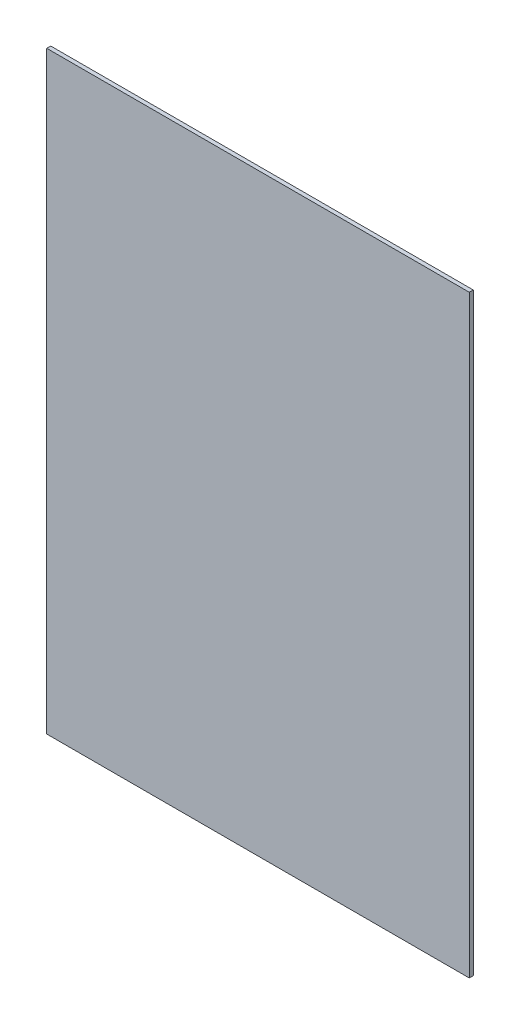
ISO-10303-21;
HEADER;
FILE_DESCRIPTION(('STEP AP214'),'2;1');
FILE_NAME('part.step','',(''),(''),'','','');
FILE_SCHEMA(('AUTOMOTIVE_DESIGN { 1 0 10303 214 1 1 1 1 }'));
ENDSEC;
DATA;
#1=APPLICATION_CONTEXT('core data for automotive mechanical design processes');
#2=APPLICATION_PROTOCOL_DEFINITION('international standard','automotive_design',2000,#1);
#3=PRODUCT_CONTEXT('',#1,'mechanical');
#4=PRODUCT('Part','Part','',(#3));
#5=PRODUCT_RELATED_PRODUCT_CATEGORY('part','',(#4));
#6=PRODUCT_DEFINITION_FORMATION('','',#4);
#7=PRODUCT_DEFINITION_CONTEXT('part definition',#1,'design');
#8=PRODUCT_DEFINITION('design','',#6,#7);
#9=PRODUCT_DEFINITION_SHAPE('','',#8);
#10=(LENGTH_UNIT() NAMED_UNIT(*) SI_UNIT(.MILLI.,.METRE.));
#11=(NAMED_UNIT(*) PLANE_ANGLE_UNIT() SI_UNIT($,.RADIAN.));
#12=(NAMED_UNIT(*) SI_UNIT($,.STERADIAN.) SOLID_ANGLE_UNIT());
#13=UNCERTAINTY_MEASURE_WITH_UNIT(LENGTH_MEASURE(1.E-05),#10,'distance_accuracy_value','');
#14=(GEOMETRIC_REPRESENTATION_CONTEXT(3) GLOBAL_UNCERTAINTY_ASSIGNED_CONTEXT((#13)) GLOBAL_UNIT_ASSIGNED_CONTEXT((#10,
#11,#12)) REPRESENTATION_CONTEXT('',''));
#15=CARTESIAN_POINT('',(0.,0.,0.));
#16=DIRECTION('',(0.,0.,1.));
#17=DIRECTION('',(1.,0.,0.));
#18=AXIS2_PLACEMENT_3D('',#15,#16,#17);
#19=CARTESIAN_POINT('',(0.,0.,5.08));
#20=DIRECTION('',(-1.,0.,0.));
#21=DIRECTION('',(0.,0.,1.));
#22=AXIS2_PLACEMENT_3D('',#19,#20,#21);
#23=PLANE('',#22);
#24=DIRECTION('',(0.,1.,0.));
#25=VECTOR('',#24,1.);
#26=CARTESIAN_POINT('',(0.,0.,0.));
#27=LINE('',#26,#25);
#28=CARTESIAN_POINT('',(0.,0.,0.));
#29=VERTEX_POINT('',#28);
#30=CARTESIAN_POINT('',(0.,758.9266,0.));
#31=VERTEX_POINT('',#30);
#32=EDGE_CURVE('E98',#29,#31,#27,.T.);
#33=ORIENTED_EDGE('',*,*,#32,.F.);
#34=DIRECTION('',(0.,0.,-1.));
#35=VECTOR('',#34,1.);
#36=CARTESIAN_POINT('',(0.,0.,5.08));
#37=LINE('',#36,#35);
#38=CARTESIAN_POINT('',(0.,0.,5.08));
#39=VERTEX_POINT('',#38);
#40=EDGE_CURVE('E11',#39,#29,#37,.T.);
#41=ORIENTED_EDGE('',*,*,#40,.F.);
#42=DIRECTION('',(0.,1.,0.));
#43=VECTOR('',#42,1.);
#44=CARTESIAN_POINT('',(0.,0.,5.08));
#45=LINE('',#44,#43);
#46=CARTESIAN_POINT('',(0.,758.9266,5.08));
#47=VERTEX_POINT('',#46);
#48=EDGE_CURVE('E93',#39,#47,#45,.T.);
#49=ORIENTED_EDGE('',*,*,#48,.T.);
#50=DIRECTION('',(0.,0.,-1.));
#51=VECTOR('',#50,1.);
#52=CARTESIAN_POINT('',(0.,758.9266,5.08));
#53=LINE('',#52,#51);
#54=EDGE_CURVE('E36',#47,#31,#53,.T.);
#55=ORIENTED_EDGE('',*,*,#54,.T.);
#56=EDGE_LOOP('',(#33,#41,#49,#55));
#57=FACE_BOUND('',#56,.T.);
#58=ADVANCED_FACE('F33',(#57),#23,.T.);
#59=CARTESIAN_POINT('',(0.,0.,5.08));
#60=DIRECTION('',(0.,1.,0.));
#61=DIRECTION('',(0.,0.,1.));
#62=AXIS2_PLACEMENT_3D('',#59,#60,#61);
#63=PLANE('',#62);
#64=DIRECTION('',(1.,0.,0.));
#65=VECTOR('',#64,1.);
#66=CARTESIAN_POINT('',(0.,0.,0.));
#67=LINE('',#66,#65);
#68=CARTESIAN_POINT('',(539.9532,0.,0.));
#69=VERTEX_POINT('',#68);
#70=EDGE_CURVE('E66',#29,#69,#67,.T.);
#71=ORIENTED_EDGE('',*,*,#70,.T.);
#72=DIRECTION('',(0.,0.,-1.));
#73=VECTOR('',#72,1.);
#74=CARTESIAN_POINT('',(539.9532,0.,5.08));
#75=LINE('',#74,#73);
#76=CARTESIAN_POINT('',(539.9532,0.,5.08));
#77=VERTEX_POINT('',#76);
#78=EDGE_CURVE('E42',#77,#69,#75,.T.);
#79=ORIENTED_EDGE('',*,*,#78,.F.);
#80=DIRECTION('',(1.,0.,0.));
#81=VECTOR('',#80,1.);
#82=CARTESIAN_POINT('',(0.,0.,5.08));
#83=LINE('',#82,#81);
#84=EDGE_CURVE('E83',#39,#77,#83,.T.);
#85=ORIENTED_EDGE('',*,*,#84,.F.);
#86=ORIENTED_EDGE('',*,*,#40,.T.);
#87=EDGE_LOOP('',(#71,#79,#85,#86));
#88=FACE_BOUND('',#87,.T.);
#89=ADVANCED_FACE('F108',(#88),#63,.F.);
#90=CARTESIAN_POINT('',(539.9532,0.,5.08));
#91=DIRECTION('',(-1.,0.,0.));
#92=DIRECTION('',(0.,0.,1.));
#93=AXIS2_PLACEMENT_3D('',#90,#91,#92);
#94=PLANE('',#93);
#95=DIRECTION('',(0.,1.,0.));
#96=VECTOR('',#95,1.);
#97=CARTESIAN_POINT('',(539.9532,0.,0.));
#98=LINE('',#97,#96);
#99=CARTESIAN_POINT('',(539.9532,758.9266,0.));
#100=VERTEX_POINT('',#99);
#101=EDGE_CURVE('E90',#69,#100,#98,.T.);
#102=ORIENTED_EDGE('',*,*,#101,.T.);
#103=DIRECTION('',(0.,0.,-1.));
#104=VECTOR('',#103,1.);
#105=CARTESIAN_POINT('',(539.9532,758.9266,5.08));
#106=LINE('',#105,#104);
#107=CARTESIAN_POINT('',(539.9532,758.9266,5.08));
#108=VERTEX_POINT('',#107);
#109=EDGE_CURVE('E87',#108,#100,#106,.T.);
#110=ORIENTED_EDGE('',*,*,#109,.F.);
#111=DIRECTION('',(0.,1.,0.));
#112=VECTOR('',#111,1.);
#113=CARTESIAN_POINT('',(539.9532,0.,5.08));
#114=LINE('',#113,#112);
#115=EDGE_CURVE('E78',#77,#108,#114,.T.);
#116=ORIENTED_EDGE('',*,*,#115,.F.);
#117=ORIENTED_EDGE('',*,*,#78,.T.);
#118=EDGE_LOOP('',(#102,#110,#116,#117));
#119=FACE_BOUND('',#118,.T.);
#120=ADVANCED_FACE('F88',(#119),#94,.F.);
#121=CARTESIAN_POINT('',(0.,758.9266,5.08));
#122=DIRECTION('',(0.,1.,0.));
#123=DIRECTION('',(0.,0.,1.));
#124=AXIS2_PLACEMENT_3D('',#121,#122,#123);
#125=PLANE('',#124);
#126=DIRECTION('',(1.,0.,0.));
#127=VECTOR('',#126,1.);
#128=CARTESIAN_POINT('',(0.,758.9266,0.));
#129=LINE('',#128,#127);
#130=EDGE_CURVE('E101',#31,#100,#129,.T.);
#131=ORIENTED_EDGE('',*,*,#130,.F.);
#132=ORIENTED_EDGE('',*,*,#54,.F.);
#133=DIRECTION('',(1.,0.,0.));
#134=VECTOR('',#133,1.);
#135=CARTESIAN_POINT('',(0.,758.9266,5.08));
#136=LINE('',#135,#134);
#137=EDGE_CURVE('E82',#47,#108,#136,.T.);
#138=ORIENTED_EDGE('',*,*,#137,.T.);
#139=ORIENTED_EDGE('',*,*,#109,.T.);
#140=EDGE_LOOP('',(#131,#132,#138,#139));
#141=FACE_BOUND('',#140,.T.);
#142=ADVANCED_FACE('F92',(#141),#125,.T.);
#143=CARTESIAN_POINT('',(0.,0.,5.08));
#144=DIRECTION('',(0.,0.,-1.));
#145=DIRECTION('',(-1.,0.,0.));
#146=AXIS2_PLACEMENT_3D('',#143,#144,#145);
#147=PLANE('',#146);
#148=ORIENTED_EDGE('',*,*,#48,.F.);
#149=ORIENTED_EDGE('',*,*,#84,.T.);
#150=ORIENTED_EDGE('',*,*,#115,.T.);
#151=ORIENTED_EDGE('',*,*,#137,.F.);
#152=EDGE_LOOP('',(#148,#149,#150,#151));
#153=FACE_BOUND('',#152,.T.);
#154=ADVANCED_FACE('F81',(#153),#147,.F.);
#155=CARTESIAN_POINT('',(0.,0.,0.));
#156=DIRECTION('',(0.,0.,-1.));
#157=DIRECTION('',(-1.,0.,0.));
#158=AXIS2_PLACEMENT_3D('',#155,#156,#157);
#159=PLANE('',#158);
#160=ORIENTED_EDGE('',*,*,#32,.T.);
#161=ORIENTED_EDGE('',*,*,#130,.T.);
#162=ORIENTED_EDGE('',*,*,#101,.F.);
#163=ORIENTED_EDGE('',*,*,#70,.F.);
#164=EDGE_LOOP('',(#160,#161,#162,#163));
#165=FACE_BOUND('',#164,.T.);
#166=ADVANCED_FACE('F106',(#165),#159,.T.);
#167=CLOSED_SHELL('',(#58,#89,#120,#142,#154,#166));
#168=MANIFOLD_SOLID_BREP('B2',#167);
#169=ADVANCED_BREP_SHAPE_REPRESENTATION('',(#18,#168),#14);
#170=SHAPE_DEFINITION_REPRESENTATION(#9,#169);
ENDSEC;
END-ISO-10303-21;
